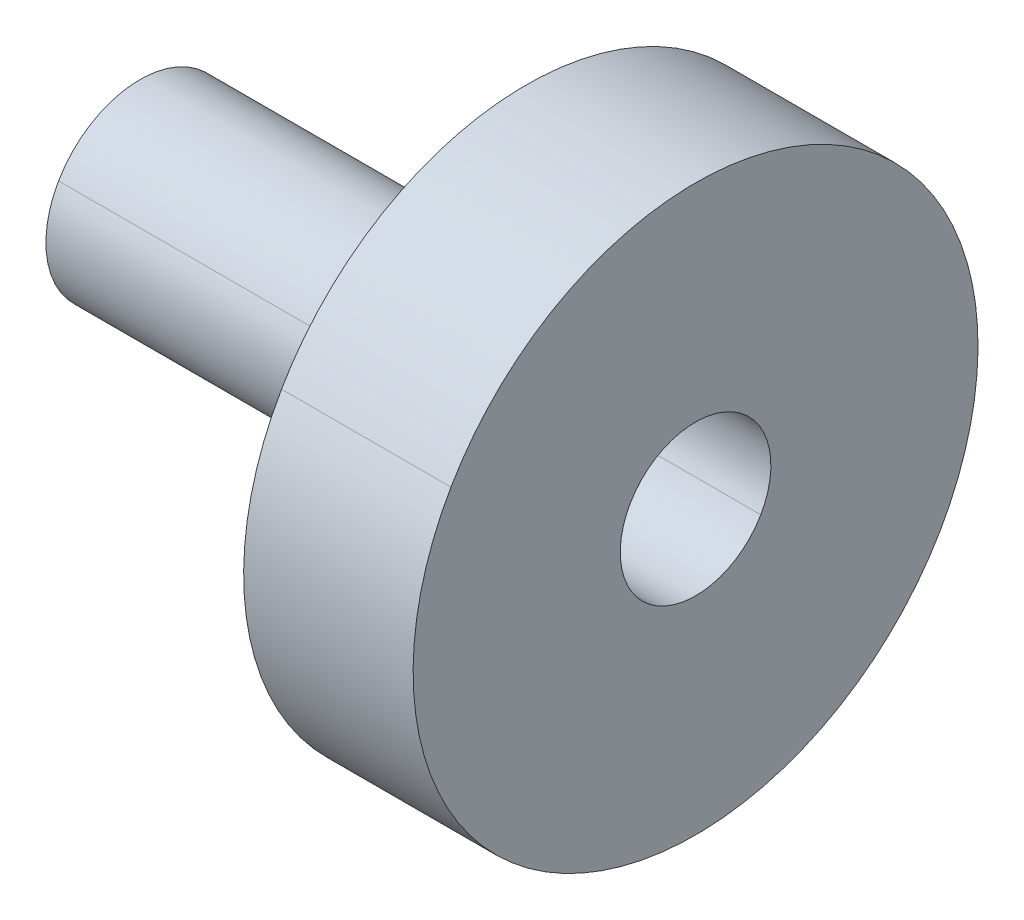
ISO-10303-21;
HEADER;
FILE_DESCRIPTION(('STEP AP214'),'2;1');
FILE_NAME('part.step','',(''),(''),'','','');
FILE_SCHEMA(('AUTOMOTIVE_DESIGN { 1 0 10303 214 1 1 1 1 }'));
ENDSEC;
DATA;
#1=APPLICATION_CONTEXT('core data for automotive mechanical design processes');
#2=APPLICATION_PROTOCOL_DEFINITION('international standard','automotive_design',2000,#1);
#3=PRODUCT_CONTEXT('',#1,'mechanical');
#4=PRODUCT('Part','Part','',(#3));
#5=PRODUCT_RELATED_PRODUCT_CATEGORY('part','',(#4));
#6=PRODUCT_DEFINITION_FORMATION('','',#4);
#7=PRODUCT_DEFINITION_CONTEXT('part definition',#1,'design');
#8=PRODUCT_DEFINITION('design','',#6,#7);
#9=PRODUCT_DEFINITION_SHAPE('','',#8);
#10=(LENGTH_UNIT() NAMED_UNIT(*) SI_UNIT(.MILLI.,.METRE.));
#11=(NAMED_UNIT(*) PLANE_ANGLE_UNIT() SI_UNIT($,.RADIAN.));
#12=(NAMED_UNIT(*) SI_UNIT($,.STERADIAN.) SOLID_ANGLE_UNIT());
#13=UNCERTAINTY_MEASURE_WITH_UNIT(LENGTH_MEASURE(1.E-05),#10,'distance_accuracy_value','');
#14=(GEOMETRIC_REPRESENTATION_CONTEXT(3) GLOBAL_UNCERTAINTY_ASSIGNED_CONTEXT((#13)) GLOBAL_UNIT_ASSIGNED_CONTEXT((#10,
#11,#12)) REPRESENTATION_CONTEXT('',''));
#15=CARTESIAN_POINT('',(0.,0.,0.));
#16=DIRECTION('',(0.,0.,1.));
#17=DIRECTION('',(1.,0.,0.));
#18=AXIS2_PLACEMENT_3D('',#15,#16,#17);
#19=CARTESIAN_POINT('',(-101.0899999997,-25.,-64.));
#20=DIRECTION('',(-1.,0.,0.));
#21=DIRECTION('',(0.,0.5,0.866025403784439));
#22=AXIS2_PLACEMENT_3D('',#19,#20,#21);
#23=CYLINDRICAL_SURFACE('',#22,4.);
#24=CARTESIAN_POINT('',(-89.5,-25.,-64.));
#25=DIRECTION('',(-1.,0.,0.));
#26=DIRECTION('',(0.,-0.5,-0.866025403784439));
#27=AXIS2_PLACEMENT_3D('',#24,#25,#26);
#28=CIRCLE('',#27,4.);
#29=CARTESIAN_POINT('',(-89.5,-23.,-60.5358983848622));
#30=VERTEX_POINT('',#29);
#31=CARTESIAN_POINT('',(-89.5,-27.,-67.4641016151378));
#32=VERTEX_POINT('',#31);
#33=EDGE_CURVE('E36',#30,#32,#28,.T.);
#34=ORIENTED_EDGE('',*,*,#33,.F.);
#35=DIRECTION('',(1.,0.,0.));
#36=VECTOR('',#35,1.);
#37=CARTESIAN_POINT('',(-101.0899999997,-23.,-60.5358983848622));
#38=LINE('',#37,#36);
#39=CARTESIAN_POINT('',(-114.,-23.,-60.5358983848622));
#40=VERTEX_POINT('',#39);
#41=EDGE_CURVE('E101',#40,#30,#38,.T.);
#42=ORIENTED_EDGE('',*,*,#41,.F.);
#43=CARTESIAN_POINT('',(-114.,-25.,-64.));
#44=DIRECTION('',(-1.,0.,0.));
#45=DIRECTION('',(0.,-0.5,-0.866025403784439));
#46=AXIS2_PLACEMENT_3D('',#43,#44,#45);
#47=CIRCLE('',#46,4.);
#48=CARTESIAN_POINT('',(-114.,-27.,-67.4641016151378));
#49=VERTEX_POINT('',#48);
#50=EDGE_CURVE('E11',#40,#49,#47,.T.);
#51=ORIENTED_EDGE('',*,*,#50,.T.);
#52=DIRECTION('',(1.,0.,0.));
#53=VECTOR('',#52,1.);
#54=CARTESIAN_POINT('',(-101.0899999997,-27.,-67.4641016151378));
#55=LINE('',#54,#53);
#56=EDGE_CURVE('E27',#49,#32,#55,.T.);
#57=ORIENTED_EDGE('',*,*,#56,.T.);
#58=EDGE_LOOP('',(#34,#42,#51,#57));
#59=FACE_BOUND('',#58,.T.);
#60=ADVANCED_FACE('F17',(#59),#23,.F.);
#61=CARTESIAN_POINT('',(-101.0899999997,-25.,-64.));
#62=DIRECTION('',(-1.,0.,0.));
#63=DIRECTION('',(0.,0.5,0.866025403784439));
#64=AXIS2_PLACEMENT_3D('',#61,#62,#63);
#65=CYLINDRICAL_SURFACE('',#64,4.);
#66=CARTESIAN_POINT('',(-89.5,-25.,-64.));
#67=DIRECTION('',(-1.,0.,0.));
#68=DIRECTION('',(0.,-0.5,-0.866025403784439));
#69=AXIS2_PLACEMENT_3D('',#66,#67,#68);
#70=CIRCLE('',#69,4.);
#71=EDGE_CURVE('E96',#32,#30,#70,.T.);
#72=ORIENTED_EDGE('',*,*,#71,.F.);
#73=ORIENTED_EDGE('',*,*,#56,.F.);
#74=CARTESIAN_POINT('',(-114.,-25.,-64.));
#75=DIRECTION('',(-1.,0.,0.));
#76=DIRECTION('',(0.,-0.5,-0.866025403784439));
#77=AXIS2_PLACEMENT_3D('',#74,#75,#76);
#78=CIRCLE('',#77,4.);
#79=EDGE_CURVE('E102',#49,#40,#78,.T.);
#80=ORIENTED_EDGE('',*,*,#79,.T.);
#81=ORIENTED_EDGE('',*,*,#41,.T.);
#82=EDGE_LOOP('',(#72,#73,#80,#81));
#83=FACE_BOUND('',#82,.T.);
#84=ADVANCED_FACE('F172',(#83),#65,.F.);
#85=CARTESIAN_POINT('',(-114.,-25.,-64.));
#86=DIRECTION('',(-1.,0.,0.));
#87=DIRECTION('',(0.,0.5,0.866025403784439));
#88=AXIS2_PLACEMENT_3D('',#85,#86,#87);
#89=PLANE('',#88);
#90=CARTESIAN_POINT('',(-114.,-25.,-64.));
#91=DIRECTION('',(-1.,0.,0.));
#92=DIRECTION('',(0.,-0.5,-0.86602540378444));
#93=AXIS2_PLACEMENT_3D('',#90,#91,#92);
#94=CIRCLE('',#93,4.2);
#95=CARTESIAN_POINT('',(-114.,-27.1,-67.6373066958947));
#96=VERTEX_POINT('',#95);
#97=CARTESIAN_POINT('',(-114.,-22.9,-60.3626933041054));
#98=VERTEX_POINT('',#97);
#99=EDGE_CURVE('E103',#96,#98,#94,.T.);
#100=ORIENTED_EDGE('',*,*,#99,.T.);
#101=CARTESIAN_POINT('',(-114.,-25.,-64.));
#102=DIRECTION('',(-1.,0.,0.));
#103=DIRECTION('',(0.,-0.5,-0.86602540378444));
#104=AXIS2_PLACEMENT_3D('',#101,#102,#103);
#105=CIRCLE('',#104,4.2);
#106=EDGE_CURVE('E110',#98,#96,#105,.T.);
#107=ORIENTED_EDGE('',*,*,#106,.T.);
#108=EDGE_LOOP('',(#100,#107));
#109=FACE_BOUND('',#108,.T.);
#110=ORIENTED_EDGE('',*,*,#79,.F.);
#111=ORIENTED_EDGE('',*,*,#50,.F.);
#112=EDGE_LOOP('',(#110,#111));
#113=FACE_BOUND('',#112,.T.);
#114=ADVANCED_FACE('F169',(#109,#113),#89,.T.);
#115=CARTESIAN_POINT('',(-116.5,-25.,-64.));
#116=DIRECTION('',(-1.,0.,0.));
#117=DIRECTION('',(0.,0.5,0.86602540378444));
#118=AXIS2_PLACEMENT_3D('',#115,#116,#117);
#119=CYLINDRICAL_SURFACE('',#118,4.2);
#120=DIRECTION('',(-1.,0.,0.));
#121=VECTOR('',#120,1.);
#122=CARTESIAN_POINT('',(-116.5,-27.1,-67.6373066958947));
#123=LINE('',#122,#121);
#124=CARTESIAN_POINT('',(-119.,-27.1,-67.6373066958947));
#125=VERTEX_POINT('',#124);
#126=EDGE_CURVE('E112',#96,#125,#123,.T.);
#127=ORIENTED_EDGE('',*,*,#126,.T.);
#128=CARTESIAN_POINT('',(-119.,-25.,-64.));
#129=DIRECTION('',(-1.,0.,0.));
#130=DIRECTION('',(0.,-0.5,-0.86602540378444));
#131=AXIS2_PLACEMENT_3D('',#128,#129,#130);
#132=CIRCLE('',#131,4.2);
#133=CARTESIAN_POINT('',(-119.,-22.9,-60.3626933041054));
#134=VERTEX_POINT('',#133);
#135=EDGE_CURVE('E115',#125,#134,#132,.T.);
#136=ORIENTED_EDGE('',*,*,#135,.T.);
#137=DIRECTION('',(-1.,0.,0.));
#138=VECTOR('',#137,1.);
#139=CARTESIAN_POINT('',(-116.5,-22.9,-60.3626933041054));
#140=LINE('',#139,#138);
#141=EDGE_CURVE('E118',#98,#134,#140,.T.);
#142=ORIENTED_EDGE('',*,*,#141,.F.);
#143=ORIENTED_EDGE('',*,*,#99,.F.);
#144=EDGE_LOOP('',(#127,#136,#142,#143));
#145=FACE_BOUND('',#144,.T.);
#146=ADVANCED_FACE('F166',(#145),#119,.F.);
#147=CARTESIAN_POINT('',(-116.5,-25.,-64.));
#148=DIRECTION('',(-1.,0.,0.));
#149=DIRECTION('',(0.,0.5,0.86602540378444));
#150=AXIS2_PLACEMENT_3D('',#147,#148,#149);
#151=CYLINDRICAL_SURFACE('',#150,4.2);
#152=ORIENTED_EDGE('',*,*,#141,.T.);
#153=CARTESIAN_POINT('',(-119.,-25.,-64.));
#154=DIRECTION('',(-1.,0.,0.));
#155=DIRECTION('',(0.,-0.5,-0.86602540378444));
#156=AXIS2_PLACEMENT_3D('',#153,#154,#155);
#157=CIRCLE('',#156,4.2);
#158=EDGE_CURVE('E120',#134,#125,#157,.T.);
#159=ORIENTED_EDGE('',*,*,#158,.T.);
#160=ORIENTED_EDGE('',*,*,#126,.F.);
#161=ORIENTED_EDGE('',*,*,#106,.F.);
#162=EDGE_LOOP('',(#152,#159,#160,#161));
#163=FACE_BOUND('',#162,.T.);
#164=ADVANCED_FACE('F159',(#163),#151,.F.);
#165=CARTESIAN_POINT('',(-119.,-25.,-64.));
#166=DIRECTION('',(-1.,0.,0.));
#167=DIRECTION('',(0.,0.5,0.866025403784439));
#168=AXIS2_PLACEMENT_3D('',#165,#166,#167);
#169=PLANE('',#168);
#170=CARTESIAN_POINT('',(-119.,-25.,-64.));
#171=DIRECTION('',(-1.,0.,0.));
#172=DIRECTION('',(0.,-0.5,-0.866025403784439));
#173=AXIS2_PLACEMENT_3D('',#170,#171,#172);
#174=CIRCLE('',#173,5.);
#175=CARTESIAN_POINT('',(-119.,-27.5,-68.3301270189222));
#176=VERTEX_POINT('',#175);
#177=CARTESIAN_POINT('',(-119.,-22.5,-59.6698729810778));
#178=VERTEX_POINT('',#177);
#179=EDGE_CURVE('E123',#176,#178,#174,.T.);
#180=ORIENTED_EDGE('',*,*,#179,.T.);
#181=CARTESIAN_POINT('',(-119.,-25.,-64.));
#182=DIRECTION('',(-1.,0.,0.));
#183=DIRECTION('',(0.,-0.5,-0.866025403784439));
#184=AXIS2_PLACEMENT_3D('',#181,#182,#183);
#185=CIRCLE('',#184,5.);
#186=EDGE_CURVE('E126',#178,#176,#185,.T.);
#187=ORIENTED_EDGE('',*,*,#186,.T.);
#188=EDGE_LOOP('',(#180,#187));
#189=FACE_BOUND('',#188,.T.);
#190=ORIENTED_EDGE('',*,*,#135,.F.);
#191=ORIENTED_EDGE('',*,*,#158,.F.);
#192=EDGE_LOOP('',(#190,#191));
#193=FACE_BOUND('',#192,.T.);
#194=ADVANCED_FACE('F156',(#189,#193),#169,.T.);
#195=CARTESIAN_POINT('',(-108.75,-25.,-64.));
#196=DIRECTION('',(-1.,0.,0.));
#197=DIRECTION('',(0.,0.5,0.866025403784439));
#198=AXIS2_PLACEMENT_3D('',#195,#196,#197);
#199=CYLINDRICAL_SURFACE('',#198,5.);
#200=DIRECTION('',(1.,0.,0.));
#201=VECTOR('',#200,1.);
#202=CARTESIAN_POINT('',(-108.75,-27.5,-68.3301270189222));
#203=LINE('',#202,#201);
#204=CARTESIAN_POINT('',(-98.5,-27.5,-68.3301270189222));
#205=VERTEX_POINT('',#204);
#206=EDGE_CURVE('E128',#176,#205,#203,.T.);
#207=ORIENTED_EDGE('',*,*,#206,.T.);
#208=CARTESIAN_POINT('',(-98.5,-25.,-64.));
#209=DIRECTION('',(-1.,0.,0.));
#210=DIRECTION('',(0.,-0.5,-0.866025403784439));
#211=AXIS2_PLACEMENT_3D('',#208,#209,#210);
#212=CIRCLE('',#211,5.);
#213=CARTESIAN_POINT('',(-98.5,-22.5,-59.6698729810778));
#214=VERTEX_POINT('',#213);
#215=EDGE_CURVE('E131',#205,#214,#212,.T.);
#216=ORIENTED_EDGE('',*,*,#215,.T.);
#217=DIRECTION('',(1.,0.,0.));
#218=VECTOR('',#217,1.);
#219=CARTESIAN_POINT('',(-108.75,-22.5,-59.6698729810778));
#220=LINE('',#219,#218);
#221=EDGE_CURVE('E134',#178,#214,#220,.T.);
#222=ORIENTED_EDGE('',*,*,#221,.F.);
#223=ORIENTED_EDGE('',*,*,#179,.F.);
#224=EDGE_LOOP('',(#207,#216,#222,#223));
#225=FACE_BOUND('',#224,.T.);
#226=ADVANCED_FACE('F153',(#225),#199,.T.);
#227=CARTESIAN_POINT('',(-108.75,-25.,-64.));
#228=DIRECTION('',(-1.,0.,0.));
#229=DIRECTION('',(0.,0.5,0.866025403784439));
#230=AXIS2_PLACEMENT_3D('',#227,#228,#229);
#231=CYLINDRICAL_SURFACE('',#230,5.);
#232=ORIENTED_EDGE('',*,*,#221,.T.);
#233=CARTESIAN_POINT('',(-98.5,-25.,-64.));
#234=DIRECTION('',(-1.,0.,0.));
#235=DIRECTION('',(0.,-0.5,-0.866025403784439));
#236=AXIS2_PLACEMENT_3D('',#233,#234,#235);
#237=CIRCLE('',#236,5.);
#238=EDGE_CURVE('E136',#214,#205,#237,.T.);
#239=ORIENTED_EDGE('',*,*,#238,.T.);
#240=ORIENTED_EDGE('',*,*,#206,.F.);
#241=ORIENTED_EDGE('',*,*,#186,.F.);
#242=EDGE_LOOP('',(#232,#239,#240,#241));
#243=FACE_BOUND('',#242,.T.);
#244=ADVANCED_FACE('F146',(#243),#231,.T.);
#245=CARTESIAN_POINT('',(-98.5,-25.,-64.));
#246=DIRECTION('',(-1.,0.,0.));
#247=DIRECTION('',(0.,0.5,0.866025403784439));
#248=AXIS2_PLACEMENT_3D('',#245,#246,#247);
#249=PLANE('',#248);
#250=CARTESIAN_POINT('',(-98.5,-25.,-64.));
#251=DIRECTION('',(-1.,0.,0.));
#252=DIRECTION('',(0.,-0.5,-0.866025403784439));
#253=AXIS2_PLACEMENT_3D('',#250,#251,#252);
#254=CIRCLE('',#253,15.);
#255=CARTESIAN_POINT('',(-98.5,-32.5,-76.9903810567666));
#256=VERTEX_POINT('',#255);
#257=CARTESIAN_POINT('',(-98.5,-17.5,-51.0096189432334));
#258=VERTEX_POINT('',#257);
#259=EDGE_CURVE('E139',#256,#258,#254,.T.);
#260=ORIENTED_EDGE('',*,*,#259,.T.);
#261=CARTESIAN_POINT('',(-98.5,-25.,-64.));
#262=DIRECTION('',(-1.,0.,0.));
#263=DIRECTION('',(0.,-0.5,-0.866025403784439));
#264=AXIS2_PLACEMENT_3D('',#261,#262,#263);
#265=CIRCLE('',#264,15.);
#266=EDGE_CURVE('E88',#258,#256,#265,.T.);
#267=ORIENTED_EDGE('',*,*,#266,.T.);
#268=EDGE_LOOP('',(#260,#267));
#269=FACE_BOUND('',#268,.T.);
#270=ORIENTED_EDGE('',*,*,#215,.F.);
#271=ORIENTED_EDGE('',*,*,#238,.F.);
#272=EDGE_LOOP('',(#270,#271));
#273=FACE_BOUND('',#272,.T.);
#274=ADVANCED_FACE('F143',(#269,#273),#249,.T.);
#275=CARTESIAN_POINT('',(-94.,-25.,-64.));
#276=DIRECTION('',(-1.,0.,0.));
#277=DIRECTION('',(0.,0.5,0.866025403784439));
#278=AXIS2_PLACEMENT_3D('',#275,#276,#277);
#279=CYLINDRICAL_SURFACE('',#278,15.);
#280=DIRECTION('',(1.,0.,0.));
#281=VECTOR('',#280,1.);
#282=CARTESIAN_POINT('',(-94.,-32.5,-76.9903810567666));
#283=LINE('',#282,#281);
#284=CARTESIAN_POINT('',(-89.5,-32.5,-76.9903810567666));
#285=VERTEX_POINT('',#284);
#286=EDGE_CURVE('E93',#256,#285,#283,.T.);
#287=ORIENTED_EDGE('',*,*,#286,.T.);
#288=CARTESIAN_POINT('',(-89.5,-25.,-64.));
#289=DIRECTION('',(-1.,0.,0.));
#290=DIRECTION('',(0.,-0.5,-0.866025403784439));
#291=AXIS2_PLACEMENT_3D('',#288,#289,#290);
#292=CIRCLE('',#291,15.);
#293=CARTESIAN_POINT('',(-89.5,-17.5,-51.0096189432334));
#294=VERTEX_POINT('',#293);
#295=EDGE_CURVE('E79',#285,#294,#292,.T.);
#296=ORIENTED_EDGE('',*,*,#295,.T.);
#297=DIRECTION('',(1.,0.,0.));
#298=VECTOR('',#297,1.);
#299=CARTESIAN_POINT('',(-94.,-17.5,-51.0096189432334));
#300=LINE('',#299,#298);
#301=EDGE_CURVE('E85',#258,#294,#300,.T.);
#302=ORIENTED_EDGE('',*,*,#301,.F.);
#303=ORIENTED_EDGE('',*,*,#259,.F.);
#304=EDGE_LOOP('',(#287,#296,#302,#303));
#305=FACE_BOUND('',#304,.T.);
#306=ADVANCED_FACE('F92',(#305),#279,.T.);
#307=CARTESIAN_POINT('',(-94.,-25.,-64.));
#308=DIRECTION('',(-1.,0.,0.));
#309=DIRECTION('',(0.,0.5,0.866025403784439));
#310=AXIS2_PLACEMENT_3D('',#307,#308,#309);
#311=CYLINDRICAL_SURFACE('',#310,15.);
#312=ORIENTED_EDGE('',*,*,#301,.T.);
#313=CARTESIAN_POINT('',(-89.5,-25.,-64.));
#314=DIRECTION('',(-1.,0.,0.));
#315=DIRECTION('',(0.,-0.5,-0.866025403784439));
#316=AXIS2_PLACEMENT_3D('',#313,#314,#315);
#317=CIRCLE('',#316,15.);
#318=EDGE_CURVE('E21',#294,#285,#317,.T.);
#319=ORIENTED_EDGE('',*,*,#318,.T.);
#320=ORIENTED_EDGE('',*,*,#286,.F.);
#321=ORIENTED_EDGE('',*,*,#266,.F.);
#322=EDGE_LOOP('',(#312,#319,#320,#321));
#323=FACE_BOUND('',#322,.T.);
#324=ADVANCED_FACE('F86',(#323),#311,.T.);
#325=CARTESIAN_POINT('',(-89.5,-25.,-64.));
#326=DIRECTION('',(-1.,0.,0.));
#327=DIRECTION('',(0.,0.5,0.866025403784439));
#328=AXIS2_PLACEMENT_3D('',#325,#326,#327);
#329=PLANE('',#328);
#330=ORIENTED_EDGE('',*,*,#318,.F.);
#331=ORIENTED_EDGE('',*,*,#295,.F.);
#332=EDGE_LOOP('',(#330,#331));
#333=FACE_BOUND('',#332,.T.);
#334=ORIENTED_EDGE('',*,*,#33,.T.);
#335=ORIENTED_EDGE('',*,*,#71,.T.);
#336=EDGE_LOOP('',(#334,#335));
#337=FACE_BOUND('',#336,.T.);
#338=ADVANCED_FACE('F19',(#333,#337),#329,.F.);
#339=CLOSED_SHELL('',(#60,#84,#114,#146,#164,#194,#226,#244,#274,#306,#324,#338));
#340=MANIFOLD_SOLID_BREP('B1',#339);
#341=ADVANCED_BREP_SHAPE_REPRESENTATION('',(#18,#340),#14);
#342=SHAPE_DEFINITION_REPRESENTATION(#9,#341);
ENDSEC;
END-ISO-10303-21;
